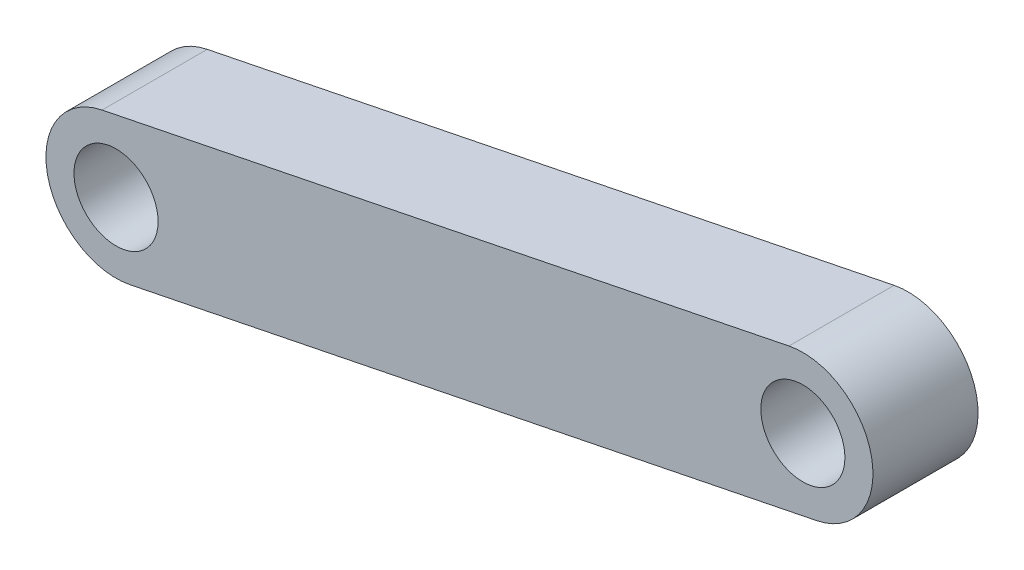
ISO-10303-21;
HEADER;
FILE_DESCRIPTION(('STEP AP214'),'2;1');
FILE_NAME('part.step','',(''),(''),'','','');
FILE_SCHEMA(('AUTOMOTIVE_DESIGN { 1 0 10303 214 1 1 1 1 }'));
ENDSEC;
DATA;
#1=APPLICATION_CONTEXT('core data for automotive mechanical design processes');
#2=APPLICATION_PROTOCOL_DEFINITION('international standard','automotive_design',2000,#1);
#3=PRODUCT_CONTEXT('',#1,'mechanical');
#4=PRODUCT('Part','Part','',(#3));
#5=PRODUCT_RELATED_PRODUCT_CATEGORY('part','',(#4));
#6=PRODUCT_DEFINITION_FORMATION('','',#4);
#7=PRODUCT_DEFINITION_CONTEXT('part definition',#1,'design');
#8=PRODUCT_DEFINITION('design','',#6,#7);
#9=PRODUCT_DEFINITION_SHAPE('','',#8);
#10=(LENGTH_UNIT() NAMED_UNIT(*) SI_UNIT(.MILLI.,.METRE.));
#11=(NAMED_UNIT(*) PLANE_ANGLE_UNIT() SI_UNIT($,.RADIAN.));
#12=(NAMED_UNIT(*) SI_UNIT($,.STERADIAN.) SOLID_ANGLE_UNIT());
#13=UNCERTAINTY_MEASURE_WITH_UNIT(LENGTH_MEASURE(1.E-05),#10,'distance_accuracy_value','');
#14=(GEOMETRIC_REPRESENTATION_CONTEXT(3) GLOBAL_UNCERTAINTY_ASSIGNED_CONTEXT((#13)) GLOBAL_UNIT_ASSIGNED_CONTEXT((#10,
#11,#12)) REPRESENTATION_CONTEXT('',''));
#15=CARTESIAN_POINT('',(0.,0.,0.));
#16=DIRECTION('',(0.,0.,1.));
#17=DIRECTION('',(1.,0.,0.));
#18=AXIS2_PLACEMENT_3D('',#15,#16,#17);
#19=CARTESIAN_POINT('',(0.,0.,30.));
#20=DIRECTION('',(0.,0.,1.));
#21=DIRECTION('',(1.,0.,0.));
#22=AXIS2_PLACEMENT_3D('',#19,#20,#21);
#23=PLANE('',#22);
#24=CARTESIAN_POINT('',(0.,0.,30.));
#25=DIRECTION('',(0.,0.,1.));
#26=DIRECTION('',(1.,0.,0.));
#27=AXIS2_PLACEMENT_3D('',#24,#25,#26);
#28=CIRCLE('',#27,12.);
#29=CARTESIAN_POINT('',(12.,0.,30.));
#30=VERTEX_POINT('',#29);
#31=EDGE_CURVE('E112',#30,#30,#28,.T.);
#32=ORIENTED_EDGE('',*,*,#31,.F.);
#33=EDGE_LOOP('',(#32));
#34=FACE_BOUND('',#33,.T.);
#35=CARTESIAN_POINT('',(0.,0.,30.));
#36=DIRECTION('',(0.,0.,1.));
#37=DIRECTION('',(1.,0.,0.));
#38=AXIS2_PLACEMENT_3D('',#35,#36,#37);
#39=CIRCLE('',#38,20.);
#40=CARTESIAN_POINT('',(-3.96903264333854,19.6022136473438,30.));
#41=VERTEX_POINT('',#40);
#42=CARTESIAN_POINT('',(3.96903264333854,-19.6022136473438,30.));
#43=VERTEX_POINT('',#42);
#44=EDGE_CURVE('E92',#41,#43,#39,.T.);
#45=ORIENTED_EDGE('',*,*,#44,.T.);
#46=DIRECTION('',(0.980110682367192,0.198451632166927,0.));
#47=VECTOR('',#46,1.);
#48=CARTESIAN_POINT('',(3.96903264333854,-19.6022136473438,30.));
#49=LINE('',#48,#47);
#50=CARTESIAN_POINT('',(199.991169116777,20.0881127860416,30.));
#51=VERTEX_POINT('',#50);
#52=EDGE_CURVE('E87',#43,#51,#49,.T.);
#53=ORIENTED_EDGE('',*,*,#52,.T.);
#54=CARTESIAN_POINT('',(196.022136473438,39.6903264333854,30.));
#55=DIRECTION('',(0.,0.,1.));
#56=DIRECTION('',(1.,0.,0.));
#57=AXIS2_PLACEMENT_3D('',#54,#55,#56);
#58=CIRCLE('',#57,20.);
#59=CARTESIAN_POINT('',(192.0531038301,59.2925400807293,30.));
#60=VERTEX_POINT('',#59);
#61=EDGE_CURVE('E90',#51,#60,#58,.T.);
#62=ORIENTED_EDGE('',*,*,#61,.T.);
#63=DIRECTION('',(-0.980110682367192,-0.198451632166927,0.));
#64=VECTOR('',#63,1.);
#65=CARTESIAN_POINT('',(-3.96903264333854,19.6022136473438,30.));
#66=LINE('',#65,#64);
#67=EDGE_CURVE('E57',#60,#41,#66,.T.);
#68=ORIENTED_EDGE('',*,*,#67,.T.);
#69=EDGE_LOOP('',(#45,#53,#62,#68));
#70=FACE_BOUND('',#69,.T.);
#71=CARTESIAN_POINT('',(196.022136473438,39.6903264333854,30.));
#72=DIRECTION('',(0.,0.,1.));
#73=DIRECTION('',(1.,0.,0.));
#74=AXIS2_PLACEMENT_3D('',#71,#72,#73);
#75=CIRCLE('',#74,12.);
#76=CARTESIAN_POINT('',(208.022136473438,39.6903264333854,30.));
#77=VERTEX_POINT('',#76);
#78=EDGE_CURVE('E134',#77,#77,#75,.T.);
#79=ORIENTED_EDGE('',*,*,#78,.F.);
#80=EDGE_LOOP('',(#79));
#81=FACE_BOUND('',#80,.T.);
#82=ADVANCED_FACE('F39',(#34,#70,#81),#23,.T.);
#83=CARTESIAN_POINT('',(0.,0.,0.));
#84=DIRECTION('',(0.,0.,1.));
#85=DIRECTION('',(1.,0.,0.));
#86=AXIS2_PLACEMENT_3D('',#83,#84,#85);
#87=PLANE('',#86);
#88=CARTESIAN_POINT('',(0.,0.,0.));
#89=DIRECTION('',(0.,0.,1.));
#90=DIRECTION('',(1.,0.,0.));
#91=AXIS2_PLACEMENT_3D('',#88,#89,#90);
#92=CIRCLE('',#91,20.);
#93=CARTESIAN_POINT('',(-3.96903264333854,19.6022136473438,0.));
#94=VERTEX_POINT('',#93);
#95=CARTESIAN_POINT('',(3.96903264333854,-19.6022136473438,0.));
#96=VERTEX_POINT('',#95);
#97=EDGE_CURVE('E108',#94,#96,#92,.T.);
#98=ORIENTED_EDGE('',*,*,#97,.F.);
#99=DIRECTION('',(-0.980110682367192,-0.198451632166927,0.));
#100=VECTOR('',#99,1.);
#101=CARTESIAN_POINT('',(-3.96903264333854,19.6022136473438,0.));
#102=LINE('',#101,#100);
#103=CARTESIAN_POINT('',(192.0531038301,59.2925400807293,0.));
#104=VERTEX_POINT('',#103);
#105=EDGE_CURVE('E80',#104,#94,#102,.T.);
#106=ORIENTED_EDGE('',*,*,#105,.F.);
#107=CARTESIAN_POINT('',(196.022136473438,39.6903264333854,0.));
#108=DIRECTION('',(0.,0.,1.));
#109=DIRECTION('',(1.,0.,0.));
#110=AXIS2_PLACEMENT_3D('',#107,#108,#109);
#111=CIRCLE('',#110,20.);
#112=CARTESIAN_POINT('',(199.991169116777,20.0881127860416,0.));
#113=VERTEX_POINT('',#112);
#114=EDGE_CURVE('E74',#113,#104,#111,.T.);
#115=ORIENTED_EDGE('',*,*,#114,.F.);
#116=DIRECTION('',(0.980110682367192,0.198451632166927,0.));
#117=VECTOR('',#116,1.);
#118=CARTESIAN_POINT('',(3.96903264333854,-19.6022136473438,0.));
#119=LINE('',#118,#117);
#120=EDGE_CURVE('E97',#96,#113,#119,.T.);
#121=ORIENTED_EDGE('',*,*,#120,.F.);
#122=EDGE_LOOP('',(#98,#106,#115,#121));
#123=FACE_BOUND('',#122,.T.);
#124=CARTESIAN_POINT('',(0.,0.,0.));
#125=DIRECTION('',(0.,0.,1.));
#126=DIRECTION('',(1.,0.,0.));
#127=AXIS2_PLACEMENT_3D('',#124,#125,#126);
#128=CIRCLE('',#127,12.);
#129=CARTESIAN_POINT('',(12.,0.,0.));
#130=VERTEX_POINT('',#129);
#131=EDGE_CURVE('E130',#130,#130,#128,.T.);
#132=ORIENTED_EDGE('',*,*,#131,.T.);
#133=EDGE_LOOP('',(#132));
#134=FACE_BOUND('',#133,.T.);
#135=CARTESIAN_POINT('',(196.022136473438,39.6903264333854,0.));
#136=DIRECTION('',(0.,0.,1.));
#137=DIRECTION('',(1.,0.,0.));
#138=AXIS2_PLACEMENT_3D('',#135,#136,#137);
#139=CIRCLE('',#138,12.);
#140=CARTESIAN_POINT('',(208.022136473438,39.6903264333854,0.));
#141=VERTEX_POINT('',#140);
#142=EDGE_CURVE('E138',#141,#141,#139,.T.);
#143=ORIENTED_EDGE('',*,*,#142,.T.);
#144=EDGE_LOOP('',(#143));
#145=FACE_BOUND('',#144,.T.);
#146=ADVANCED_FACE('F125',(#123,#134,#145),#87,.F.);
#147=CARTESIAN_POINT('',(0.,0.,30.));
#148=DIRECTION('',(0.,0.,-1.));
#149=DIRECTION('',(-1.,0.,0.));
#150=AXIS2_PLACEMENT_3D('',#147,#148,#149);
#151=CYLINDRICAL_SURFACE('',#150,20.);
#152=ORIENTED_EDGE('',*,*,#97,.T.);
#153=DIRECTION('',(0.,0.,-1.));
#154=VECTOR('',#153,1.);
#155=CARTESIAN_POINT('',(3.96903264333854,-19.6022136473438,30.));
#156=LINE('',#155,#154);
#157=EDGE_CURVE('E11',#43,#96,#156,.T.);
#158=ORIENTED_EDGE('',*,*,#157,.F.);
#159=ORIENTED_EDGE('',*,*,#44,.F.);
#160=DIRECTION('',(0.,0.,-1.));
#161=VECTOR('',#160,1.);
#162=CARTESIAN_POINT('',(-3.96903264333854,19.6022136473438,30.));
#163=LINE('',#162,#161);
#164=EDGE_CURVE('E104',#41,#94,#163,.T.);
#165=ORIENTED_EDGE('',*,*,#164,.T.);
#166=EDGE_LOOP('',(#152,#158,#159,#165));
#167=FACE_BOUND('',#166,.T.);
#168=ADVANCED_FACE('F41',(#167),#151,.T.);
#169=CARTESIAN_POINT('',(3.96903264333854,-19.6022136473438,30.));
#170=DIRECTION('',(-0.198451632166927,0.980110682367192,0.));
#171=DIRECTION('',(-0.980110682367192,-0.198451632166927,0.));
#172=AXIS2_PLACEMENT_3D('',#169,#170,#171);
#173=PLANE('',#172);
#174=ORIENTED_EDGE('',*,*,#120,.T.);
#175=DIRECTION('',(0.,0.,-1.));
#176=VECTOR('',#175,1.);
#177=CARTESIAN_POINT('',(199.991169116777,20.0881127860416,30.));
#178=LINE('',#177,#176);
#179=EDGE_CURVE('E49',#51,#113,#178,.T.);
#180=ORIENTED_EDGE('',*,*,#179,.F.);
#181=ORIENTED_EDGE('',*,*,#52,.F.);
#182=ORIENTED_EDGE('',*,*,#157,.T.);
#183=EDGE_LOOP('',(#174,#180,#181,#182));
#184=FACE_BOUND('',#183,.T.);
#185=ADVANCED_FACE('F96',(#184),#173,.F.);
#186=CARTESIAN_POINT('',(196.022136473438,39.6903264333854,30.));
#187=DIRECTION('',(0.,0.,-1.));
#188=DIRECTION('',(-1.,0.,0.));
#189=AXIS2_PLACEMENT_3D('',#186,#187,#188);
#190=CYLINDRICAL_SURFACE('',#189,20.);
#191=ORIENTED_EDGE('',*,*,#114,.T.);
#192=DIRECTION('',(0.,0.,-1.));
#193=VECTOR('',#192,1.);
#194=CARTESIAN_POINT('',(192.0531038301,59.2925400807293,30.));
#195=LINE('',#194,#193);
#196=EDGE_CURVE('E99',#60,#104,#195,.T.);
#197=ORIENTED_EDGE('',*,*,#196,.F.);
#198=ORIENTED_EDGE('',*,*,#61,.F.);
#199=ORIENTED_EDGE('',*,*,#179,.T.);
#200=EDGE_LOOP('',(#191,#197,#198,#199));
#201=FACE_BOUND('',#200,.T.);
#202=ADVANCED_FACE('F100',(#201),#190,.T.);
#203=CARTESIAN_POINT('',(-3.96903264333854,19.6022136473438,30.));
#204=DIRECTION('',(0.198451632166927,-0.980110682367192,0.));
#205=DIRECTION('',(0.980110682367192,0.198451632166927,0.));
#206=AXIS2_PLACEMENT_3D('',#203,#204,#205);
#207=PLANE('',#206);
#208=ORIENTED_EDGE('',*,*,#105,.T.);
#209=ORIENTED_EDGE('',*,*,#164,.F.);
#210=ORIENTED_EDGE('',*,*,#67,.F.);
#211=ORIENTED_EDGE('',*,*,#196,.T.);
#212=EDGE_LOOP('',(#208,#209,#210,#211));
#213=FACE_BOUND('',#212,.T.);
#214=ADVANCED_FACE('F122',(#213),#207,.F.);
#215=CARTESIAN_POINT('',(0.,0.,30.));
#216=DIRECTION('',(0.,0.,-1.));
#217=DIRECTION('',(-1.,0.,0.));
#218=AXIS2_PLACEMENT_3D('',#215,#216,#217);
#219=CYLINDRICAL_SURFACE('',#218,12.);
#220=ORIENTED_EDGE('',*,*,#31,.T.);
#221=EDGE_LOOP('',(#220));
#222=FACE_BOUND('',#221,.T.);
#223=ORIENTED_EDGE('',*,*,#131,.F.);
#224=EDGE_LOOP('',(#223));
#225=FACE_BOUND('',#224,.T.);
#226=ADVANCED_FACE('F157',(#222,#225),#219,.F.);
#227=CARTESIAN_POINT('',(196.022136473438,39.6903264333854,30.));
#228=DIRECTION('',(0.,0.,-1.));
#229=DIRECTION('',(-1.,0.,0.));
#230=AXIS2_PLACEMENT_3D('',#227,#228,#229);
#231=CYLINDRICAL_SURFACE('',#230,12.);
#232=ORIENTED_EDGE('',*,*,#78,.T.);
#233=EDGE_LOOP('',(#232));
#234=FACE_BOUND('',#233,.T.);
#235=ORIENTED_EDGE('',*,*,#142,.F.);
#236=EDGE_LOOP('',(#235));
#237=FACE_BOUND('',#236,.T.);
#238=ADVANCED_FACE('F146',(#234,#237),#231,.F.);
#239=CLOSED_SHELL('',(#82,#146,#168,#185,#202,#214,#226,#238));
#240=MANIFOLD_SOLID_BREP('B2',#239);
#241=ADVANCED_BREP_SHAPE_REPRESENTATION('',(#18,#240),#14);
#242=SHAPE_DEFINITION_REPRESENTATION(#9,#241);
ENDSEC;
END-ISO-10303-21;
